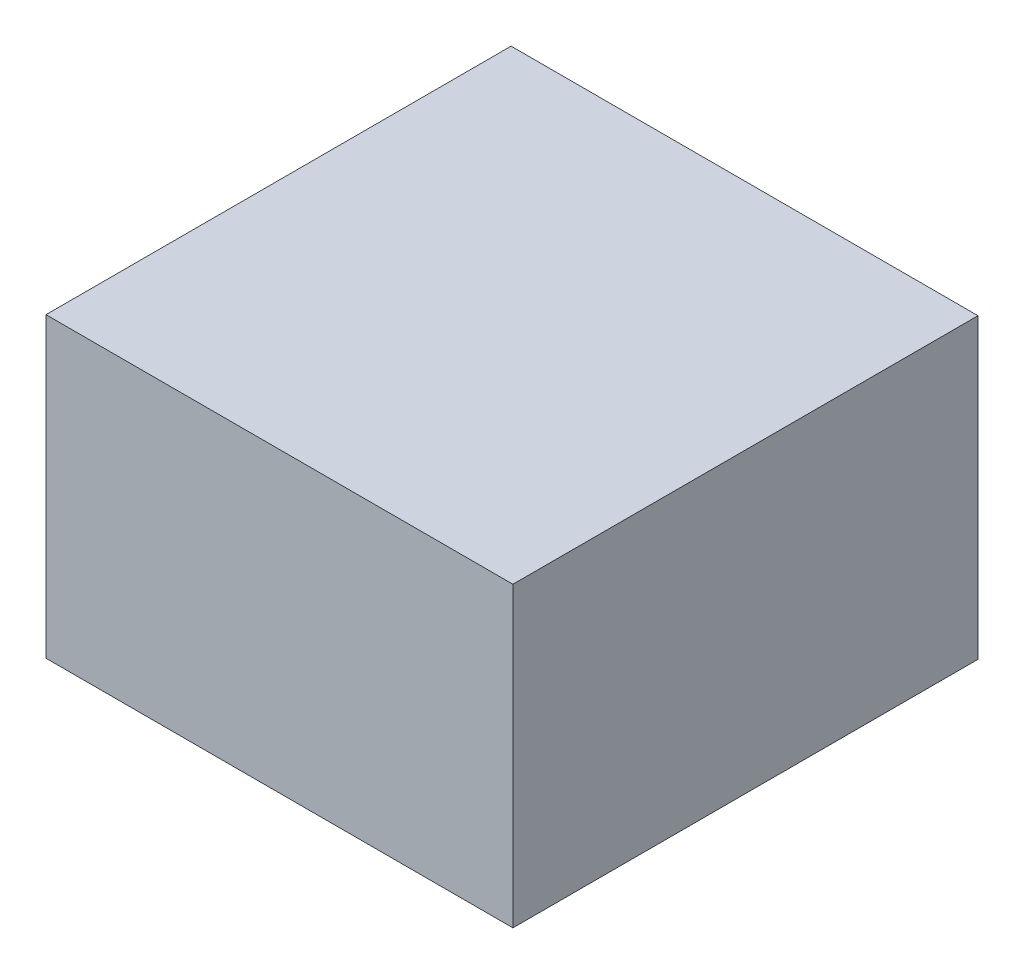
ISO-10303-21;
HEADER;
FILE_DESCRIPTION(('STEP AP214'),'2;1');
FILE_NAME('part.step','',(''),(''),'','','');
FILE_SCHEMA(('AUTOMOTIVE_DESIGN { 1 0 10303 214 1 1 1 1 }'));
ENDSEC;
DATA;
#1=APPLICATION_CONTEXT('core data for automotive mechanical design processes');
#2=APPLICATION_PROTOCOL_DEFINITION('international standard','automotive_design',2000,#1);
#3=PRODUCT_CONTEXT('',#1,'mechanical');
#4=PRODUCT('Part','Part','',(#3));
#5=PRODUCT_RELATED_PRODUCT_CATEGORY('part','',(#4));
#6=PRODUCT_DEFINITION_FORMATION('','',#4);
#7=PRODUCT_DEFINITION_CONTEXT('part definition',#1,'design');
#8=PRODUCT_DEFINITION('design','',#6,#7);
#9=PRODUCT_DEFINITION_SHAPE('','',#8);
#10=(LENGTH_UNIT() NAMED_UNIT(*) SI_UNIT(.MILLI.,.METRE.));
#11=(NAMED_UNIT(*) PLANE_ANGLE_UNIT() SI_UNIT($,.RADIAN.));
#12=(NAMED_UNIT(*) SI_UNIT($,.STERADIAN.) SOLID_ANGLE_UNIT());
#13=UNCERTAINTY_MEASURE_WITH_UNIT(LENGTH_MEASURE(1.E-05),#10,'distance_accuracy_value','');
#14=(GEOMETRIC_REPRESENTATION_CONTEXT(3) GLOBAL_UNCERTAINTY_ASSIGNED_CONTEXT((#13)) GLOBAL_UNIT_ASSIGNED_CONTEXT((#10,
#11,#12)) REPRESENTATION_CONTEXT('',''));
#15=CARTESIAN_POINT('',(0.,0.,0.));
#16=DIRECTION('',(0.,0.,1.));
#17=DIRECTION('',(1.,0.,0.));
#18=AXIS2_PLACEMENT_3D('',#15,#16,#17);
#19=CARTESIAN_POINT('',(642.5,819.,-640.));
#20=DIRECTION('',(-1.,0.,0.));
#21=DIRECTION('',(0.,0.,1.));
#22=AXIS2_PLACEMENT_3D('',#19,#20,#21);
#23=PLANE('',#22);
#24=DIRECTION('',(0.,0.,-1.));
#25=VECTOR('',#24,1.);
#26=CARTESIAN_POINT('',(642.5,0.,-640.));
#27=LINE('',#26,#25);
#28=CARTESIAN_POINT('',(642.5,0.,640.));
#29=VERTEX_POINT('',#28);
#30=CARTESIAN_POINT('',(642.5,0.,-640.));
#31=VERTEX_POINT('',#30);
#32=EDGE_CURVE('E96',#29,#31,#27,.T.);
#33=ORIENTED_EDGE('',*,*,#32,.T.);
#34=DIRECTION('',(0.,-1.,0.));
#35=VECTOR('',#34,1.);
#36=CARTESIAN_POINT('',(642.5,819.,-640.));
#37=LINE('',#36,#35);
#38=CARTESIAN_POINT('',(642.5,819.,-640.));
#39=VERTEX_POINT('',#38);
#40=EDGE_CURVE('E11',#39,#31,#37,.T.);
#41=ORIENTED_EDGE('',*,*,#40,.F.);
#42=DIRECTION('',(0.,0.,-1.));
#43=VECTOR('',#42,1.);
#44=CARTESIAN_POINT('',(642.5,819.,-640.));
#45=LINE('',#44,#43);
#46=CARTESIAN_POINT('',(642.5,819.,640.));
#47=VERTEX_POINT('',#46);
#48=EDGE_CURVE('E84',#47,#39,#45,.T.);
#49=ORIENTED_EDGE('',*,*,#48,.F.);
#50=DIRECTION('',(0.,-1.,0.));
#51=VECTOR('',#50,1.);
#52=CARTESIAN_POINT('',(642.5,819.,640.));
#53=LINE('',#52,#51);
#54=EDGE_CURVE('E92',#47,#29,#53,.T.);
#55=ORIENTED_EDGE('',*,*,#54,.T.);
#56=EDGE_LOOP('',(#33,#41,#49,#55));
#57=FACE_BOUND('',#56,.T.);
#58=ADVANCED_FACE('F33',(#57),#23,.F.);
#59=CARTESIAN_POINT('',(-642.5,819.,-640.));
#60=DIRECTION('',(0.,0.,1.));
#61=DIRECTION('',(1.,0.,0.));
#62=AXIS2_PLACEMENT_3D('',#59,#60,#61);
#63=PLANE('',#62);
#64=DIRECTION('',(-1.,0.,0.));
#65=VECTOR('',#64,1.);
#66=CARTESIAN_POINT('',(-642.5,0.,-640.));
#67=LINE('',#66,#65);
#68=CARTESIAN_POINT('',(-642.5,0.,-640.));
#69=VERTEX_POINT('',#68);
#70=EDGE_CURVE('E88',#31,#69,#67,.T.);
#71=ORIENTED_EDGE('',*,*,#70,.T.);
#72=DIRECTION('',(0.,-1.,0.));
#73=VECTOR('',#72,1.);
#74=CARTESIAN_POINT('',(-642.5,819.,-640.));
#75=LINE('',#74,#73);
#76=CARTESIAN_POINT('',(-642.5,819.,-640.));
#77=VERTEX_POINT('',#76);
#78=EDGE_CURVE('E41',#77,#69,#75,.T.);
#79=ORIENTED_EDGE('',*,*,#78,.F.);
#80=DIRECTION('',(-1.,0.,0.));
#81=VECTOR('',#80,1.);
#82=CARTESIAN_POINT('',(-642.5,819.,-640.));
#83=LINE('',#82,#81);
#84=EDGE_CURVE('E79',#39,#77,#83,.T.);
#85=ORIENTED_EDGE('',*,*,#84,.F.);
#86=ORIENTED_EDGE('',*,*,#40,.T.);
#87=EDGE_LOOP('',(#71,#79,#85,#86));
#88=FACE_BOUND('',#87,.T.);
#89=ADVANCED_FACE('F87',(#88),#63,.F.);
#90=CARTESIAN_POINT('',(-642.5,819.,-640.));
#91=DIRECTION('',(1.,0.,0.));
#92=DIRECTION('',(0.,0.,-1.));
#93=AXIS2_PLACEMENT_3D('',#90,#91,#92);
#94=PLANE('',#93);
#95=DIRECTION('',(0.,0.,1.));
#96=VECTOR('',#95,1.);
#97=CARTESIAN_POINT('',(-642.5,0.,-640.));
#98=LINE('',#97,#96);
#99=CARTESIAN_POINT('',(-642.5,0.,640.));
#100=VERTEX_POINT('',#99);
#101=EDGE_CURVE('E66',#69,#100,#98,.T.);
#102=ORIENTED_EDGE('',*,*,#101,.T.);
#103=DIRECTION('',(0.,-1.,0.));
#104=VECTOR('',#103,1.);
#105=CARTESIAN_POINT('',(-642.5,819.,640.));
#106=LINE('',#105,#104);
#107=CARTESIAN_POINT('',(-642.5,819.,640.));
#108=VERTEX_POINT('',#107);
#109=EDGE_CURVE('E89',#108,#100,#106,.T.);
#110=ORIENTED_EDGE('',*,*,#109,.F.);
#111=DIRECTION('',(0.,0.,1.));
#112=VECTOR('',#111,1.);
#113=CARTESIAN_POINT('',(-642.5,819.,-640.));
#114=LINE('',#113,#112);
#115=EDGE_CURVE('E82',#77,#108,#114,.T.);
#116=ORIENTED_EDGE('',*,*,#115,.F.);
#117=ORIENTED_EDGE('',*,*,#78,.T.);
#118=EDGE_LOOP('',(#102,#110,#116,#117));
#119=FACE_BOUND('',#118,.T.);
#120=ADVANCED_FACE('F90',(#119),#94,.F.);
#121=CARTESIAN_POINT('',(-642.5,819.,640.));
#122=DIRECTION('',(0.,0.,-1.));
#123=DIRECTION('',(-1.,0.,0.));
#124=AXIS2_PLACEMENT_3D('',#121,#122,#123);
#125=PLANE('',#124);
#126=DIRECTION('',(1.,0.,0.));
#127=VECTOR('',#126,1.);
#128=CARTESIAN_POINT('',(-642.5,0.,640.));
#129=LINE('',#128,#127);
#130=EDGE_CURVE('E72',#100,#29,#129,.T.);
#131=ORIENTED_EDGE('',*,*,#130,.T.);
#132=ORIENTED_EDGE('',*,*,#54,.F.);
#133=DIRECTION('',(1.,0.,0.));
#134=VECTOR('',#133,1.);
#135=CARTESIAN_POINT('',(-642.5,819.,640.));
#136=LINE('',#135,#134);
#137=EDGE_CURVE('E49',#108,#47,#136,.T.);
#138=ORIENTED_EDGE('',*,*,#137,.F.);
#139=ORIENTED_EDGE('',*,*,#109,.T.);
#140=EDGE_LOOP('',(#131,#132,#138,#139));
#141=FACE_BOUND('',#140,.T.);
#142=ADVANCED_FACE('F103',(#141),#125,.F.);
#143=CARTESIAN_POINT('',(0.,819.,0.));
#144=DIRECTION('',(0.,1.,0.));
#145=DIRECTION('',(0.,0.,1.));
#146=AXIS2_PLACEMENT_3D('',#143,#144,#145);
#147=PLANE('',#146);
#148=ORIENTED_EDGE('',*,*,#48,.T.);
#149=ORIENTED_EDGE('',*,*,#84,.T.);
#150=ORIENTED_EDGE('',*,*,#115,.T.);
#151=ORIENTED_EDGE('',*,*,#137,.T.);
#152=EDGE_LOOP('',(#148,#149,#150,#151));
#153=FACE_BOUND('',#152,.T.);
#154=ADVANCED_FACE('F80',(#153),#147,.T.);
#155=CARTESIAN_POINT('',(0.,0.,0.));
#156=DIRECTION('',(0.,1.,0.));
#157=DIRECTION('',(0.,0.,1.));
#158=AXIS2_PLACEMENT_3D('',#155,#156,#157);
#159=PLANE('',#158);
#160=ORIENTED_EDGE('',*,*,#32,.F.);
#161=ORIENTED_EDGE('',*,*,#130,.F.);
#162=ORIENTED_EDGE('',*,*,#101,.F.);
#163=ORIENTED_EDGE('',*,*,#70,.F.);
#164=EDGE_LOOP('',(#160,#161,#162,#163));
#165=FACE_BOUND('',#164,.T.);
#166=ADVANCED_FACE('F106',(#165),#159,.F.);
#167=CLOSED_SHELL('',(#58,#89,#120,#142,#154,#166));
#168=MANIFOLD_SOLID_BREP('B2',#167);
#169=ADVANCED_BREP_SHAPE_REPRESENTATION('',(#18,#168),#14);
#170=SHAPE_DEFINITION_REPRESENTATION(#9,#169);
ENDSEC;
END-ISO-10303-21;
